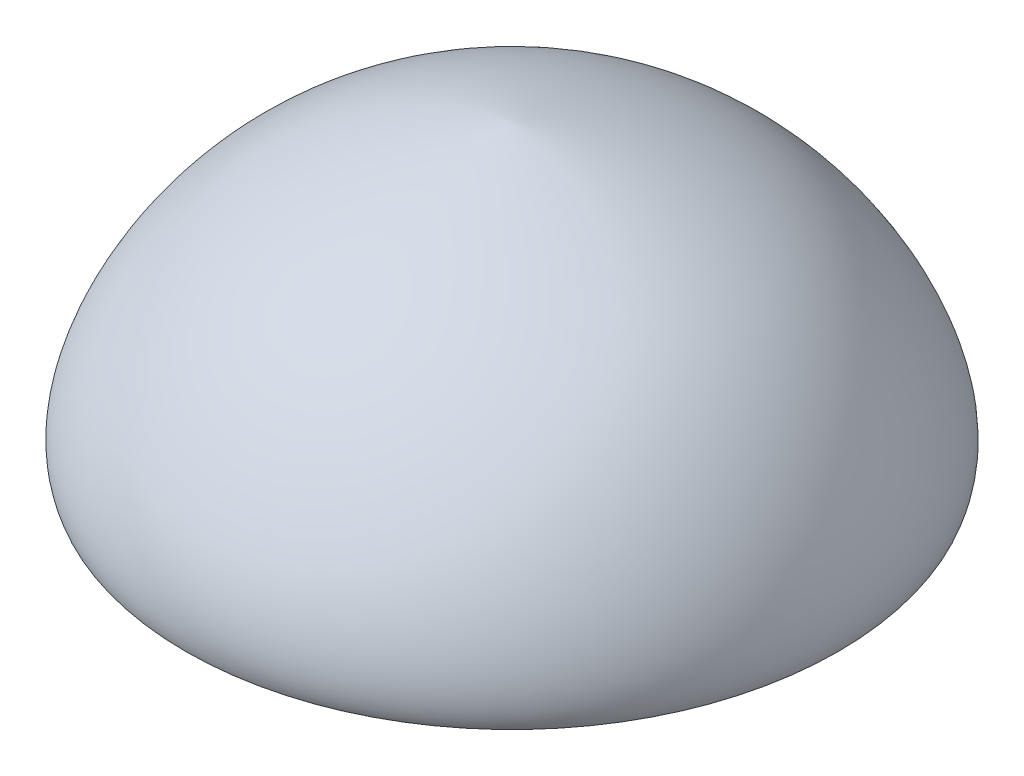
ISO-10303-21;
HEADER;
FILE_DESCRIPTION(('STEP AP214'),'2;1');
FILE_NAME('part.step','',(''),(''),'','','');
FILE_SCHEMA(('AUTOMOTIVE_DESIGN { 1 0 10303 214 1 1 1 1 }'));
ENDSEC;
DATA;
#1=APPLICATION_CONTEXT('core data for automotive mechanical design processes');
#2=APPLICATION_PROTOCOL_DEFINITION('international standard','automotive_design',2000,#1);
#3=PRODUCT_CONTEXT('',#1,'mechanical');
#4=PRODUCT('Part','Part','',(#3));
#5=PRODUCT_RELATED_PRODUCT_CATEGORY('part','',(#4));
#6=PRODUCT_DEFINITION_FORMATION('','',#4);
#7=PRODUCT_DEFINITION_CONTEXT('part definition',#1,'design');
#8=PRODUCT_DEFINITION('design','',#6,#7);
#9=PRODUCT_DEFINITION_SHAPE('','',#8);
#10=(LENGTH_UNIT() NAMED_UNIT(*) SI_UNIT(.MILLI.,.METRE.));
#11=(NAMED_UNIT(*) PLANE_ANGLE_UNIT() SI_UNIT($,.RADIAN.));
#12=(NAMED_UNIT(*) SI_UNIT($,.STERADIAN.) SOLID_ANGLE_UNIT());
#13=UNCERTAINTY_MEASURE_WITH_UNIT(LENGTH_MEASURE(1.E-05),#10,'distance_accuracy_value','');
#14=(GEOMETRIC_REPRESENTATION_CONTEXT(3) GLOBAL_UNCERTAINTY_ASSIGNED_CONTEXT((#13)) GLOBAL_UNIT_ASSIGNED_CONTEXT((#10,
#11,#12)) REPRESENTATION_CONTEXT('',''));
#15=CARTESIAN_POINT('',(0.,0.,0.));
#16=DIRECTION('',(0.,0.,1.));
#17=DIRECTION('',(1.,0.,0.));
#18=AXIS2_PLACEMENT_3D('',#15,#16,#17);
#19=CARTESIAN_POINT('',(0.5,0.,0.));
#20=CARTESIAN_POINT('',(0.525443724020926,0.0623045036922682,0.));
#21=CARTESIAN_POINT('',(0.389704349266153,0.378890471474151,0.));
#22=CARTESIAN_POINT('',(0.0254904385884982,0.45,0.));
#23=CARTESIAN_POINT('',(0.,0.45,0.));
#24=B_SPLINE_CURVE_WITH_KNOTS('',3,(#19,#20,#21,#22,#23),.UNSPECIFIED.,.F.,.F.,(4,1,4),(0.,
0.503823142963827,1.),.UNSPECIFIED.);
#25=CARTESIAN_POINT('',(0.,0.45,0.));
#26=DIRECTION('',(0.,1.,0.));
#27=AXIS1_PLACEMENT('',#25,#26);
#28=SURFACE_OF_REVOLUTION('',#24,#27);
#29=CARTESIAN_POINT('',(0.,0.45,0.));
#30=VERTEX_POINT('',#29);
#31=VERTEX_LOOP('',#30);
#32=FACE_BOUND('',#31,.T.);
#33=CARTESIAN_POINT('',(0.,0.,0.));
#34=DIRECTION('',(0.,1.,0.));
#35=DIRECTION('',(-1.,0.,0.));
#36=AXIS2_PLACEMENT_3D('',#33,#34,#35);
#37=CIRCLE('',#36,0.5);
#38=CARTESIAN_POINT('',(-0.5,0.,0.));
#39=VERTEX_POINT('',#38);
#40=EDGE_CURVE('E11',#39,#39,#37,.T.);
#41=ORIENTED_EDGE('',*,*,#40,.T.);
#42=EDGE_LOOP('',(#41));
#43=FACE_BOUND('',#42,.T.);
#44=ADVANCED_FACE('F32',(#32,#43),#28,.T.);
#45=CARTESIAN_POINT('',(0.,0.,0.));
#46=DIRECTION('',(0.,1.,0.));
#47=DIRECTION('',(-1.,0.,0.));
#48=AXIS2_PLACEMENT_3D('',#45,#46,#47);
#49=PLANE('',#48);
#50=ORIENTED_EDGE('',*,*,#40,.F.);
#51=EDGE_LOOP('',(#50));
#52=FACE_BOUND('',#51,.T.);
#53=ADVANCED_FACE('F42',(#52),#49,.F.);
#54=CLOSED_SHELL('',(#44,#53));
#55=MANIFOLD_SOLID_BREP('B2',#54);
#56=ADVANCED_BREP_SHAPE_REPRESENTATION('',(#18,#55),#14);
#57=SHAPE_DEFINITION_REPRESENTATION(#9,#56);
ENDSEC;
END-ISO-10303-21;
